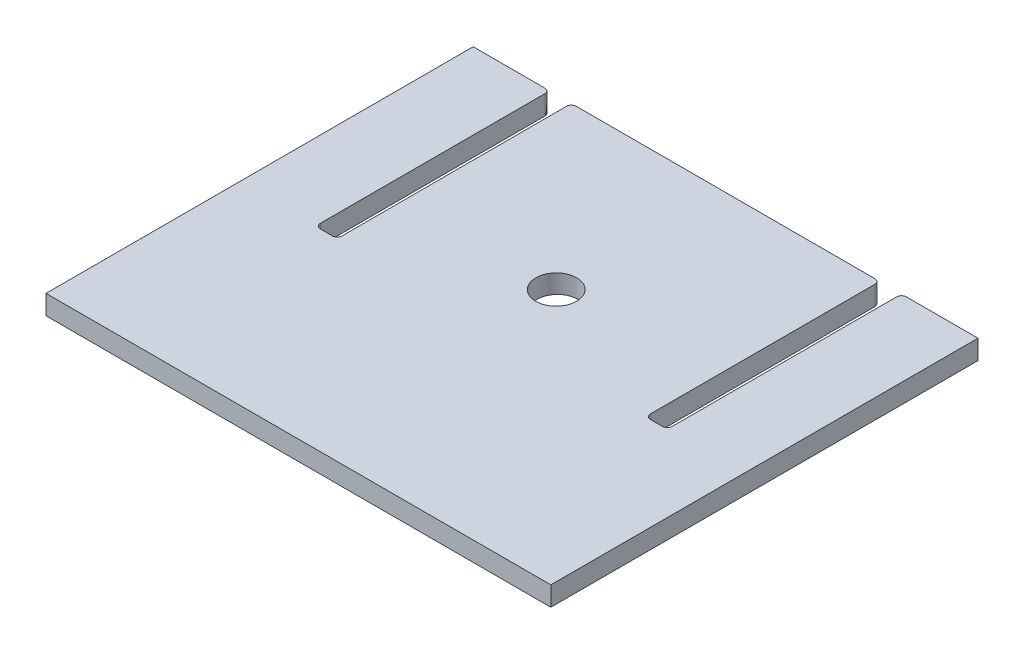
ISO-10303-21;
HEADER;
FILE_DESCRIPTION(('STEP AP214'),'2;1');
FILE_NAME('part.step','',(''),(''),'','','');
FILE_SCHEMA(('AUTOMOTIVE_DESIGN { 1 0 10303 214 1 1 1 1 }'));
ENDSEC;
DATA;
#1=APPLICATION_CONTEXT('core data for automotive mechanical design processes');
#2=APPLICATION_PROTOCOL_DEFINITION('international standard','automotive_design',2000,#1);
#3=PRODUCT_CONTEXT('',#1,'mechanical');
#4=PRODUCT('Part','Part','',(#3));
#5=PRODUCT_RELATED_PRODUCT_CATEGORY('part','',(#4));
#6=PRODUCT_DEFINITION_FORMATION('','',#4);
#7=PRODUCT_DEFINITION_CONTEXT('part definition',#1,'design');
#8=PRODUCT_DEFINITION('design','',#6,#7);
#9=PRODUCT_DEFINITION_SHAPE('','',#8);
#10=(LENGTH_UNIT() NAMED_UNIT(*) SI_UNIT(.MILLI.,.METRE.));
#11=(NAMED_UNIT(*) PLANE_ANGLE_UNIT() SI_UNIT($,.RADIAN.));
#12=(NAMED_UNIT(*) SI_UNIT($,.STERADIAN.) SOLID_ANGLE_UNIT());
#13=UNCERTAINTY_MEASURE_WITH_UNIT(LENGTH_MEASURE(1.E-05),#10,'distance_accuracy_value','');
#14=(GEOMETRIC_REPRESENTATION_CONTEXT(3) GLOBAL_UNCERTAINTY_ASSIGNED_CONTEXT((#13)) GLOBAL_UNIT_ASSIGNED_CONTEXT((#10,
#11,#12)) REPRESENTATION_CONTEXT('',''));
#15=CARTESIAN_POINT('',(0.,0.,0.));
#16=DIRECTION('',(0.,0.,1.));
#17=DIRECTION('',(1.,0.,0.));
#18=AXIS2_PLACEMENT_3D('',#15,#16,#17);
#19=CARTESIAN_POINT('',(-165.1,6.35,-139.7));
#20=DIRECTION('',(0.,0.,1.));
#21=DIRECTION('',(1.,0.,0.));
#22=AXIS2_PLACEMENT_3D('',#19,#20,#21);
#23=PLANE('',#22);
#24=DIRECTION('',(-1.,0.,0.));
#25=VECTOR('',#24,1.);
#26=CARTESIAN_POINT('',(-165.1,6.35,-139.7));
#27=LINE('',#26,#25);
#28=CARTESIAN_POINT('',(-118.237,6.35,-139.7));
#29=VERTEX_POINT('',#28);
#30=CARTESIAN_POINT('',(-165.1,6.35,-139.7));
#31=VERTEX_POINT('',#30);
#32=EDGE_CURVE('E228',#29,#31,#27,.T.);
#33=ORIENTED_EDGE('',*,*,#32,.F.);
#34=DIRECTION('',(0.,1.,0.));
#35=VECTOR('',#34,1.);
#36=CARTESIAN_POINT('',(-118.237,6.35,-139.7));
#37=LINE('',#36,#35);
#38=CARTESIAN_POINT('',(-118.237,-6.35,-139.7));
#39=VERTEX_POINT('',#38);
#40=EDGE_CURVE('E63',#29,#39,#37,.F.);
#41=ORIENTED_EDGE('',*,*,#40,.T.);
#42=DIRECTION('',(-1.,0.,0.));
#43=VECTOR('',#42,1.);
#44=CARTESIAN_POINT('',(-165.1,-6.35,-139.7));
#45=LINE('',#44,#43);
#46=CARTESIAN_POINT('',(-165.1,-6.35,-139.7));
#47=VERTEX_POINT('',#46);
#48=EDGE_CURVE('E417',#39,#47,#45,.T.);
#49=ORIENTED_EDGE('',*,*,#48,.T.);
#50=DIRECTION('',(0.,-1.,0.));
#51=VECTOR('',#50,1.);
#52=CARTESIAN_POINT('',(-165.1,6.35,-139.7));
#53=LINE('',#52,#51);
#54=EDGE_CURVE('E198',#31,#47,#53,.T.);
#55=ORIENTED_EDGE('',*,*,#54,.F.);
#56=EDGE_LOOP('',(#33,#41,#49,#55));
#57=FACE_BOUND('',#56,.T.);
#58=ADVANCED_FACE('F47',(#57),#23,.F.);
#59=CARTESIAN_POINT('',(165.1,-6.35,-139.7));
#60=VERTEX_POINT('',#59);
#61=CARTESIAN_POINT('',(118.237,-6.35,-139.7));
#62=VERTEX_POINT('',#61);
#63=EDGE_CURVE('E212',#60,#62,#45,.T.);
#64=ORIENTED_EDGE('',*,*,#63,.T.);
#65=DIRECTION('',(0.,1.,0.));
#66=VECTOR('',#65,1.);
#67=CARTESIAN_POINT('',(118.237,6.35,-139.7));
#68=LINE('',#67,#66);
#69=CARTESIAN_POINT('',(118.237,6.35,-139.7));
#70=VERTEX_POINT('',#69);
#71=EDGE_CURVE('E328',#62,#70,#68,.T.);
#72=ORIENTED_EDGE('',*,*,#71,.T.);
#73=CARTESIAN_POINT('',(165.1,6.35,-139.7));
#74=VERTEX_POINT('',#73);
#75=EDGE_CURVE('E229',#74,#70,#27,.T.);
#76=ORIENTED_EDGE('',*,*,#75,.F.);
#77=DIRECTION('',(0.,-1.,0.));
#78=VECTOR('',#77,1.);
#79=CARTESIAN_POINT('',(165.1,6.35,-139.7));
#80=LINE('',#79,#78);
#81=EDGE_CURVE('E215',#74,#60,#80,.T.);
#82=ORIENTED_EDGE('',*,*,#81,.T.);
#83=EDGE_LOOP('',(#64,#72,#76,#82));
#84=FACE_BOUND('',#83,.T.);
#85=ADVANCED_FACE('F462',(#84),#23,.F.);
#86=CARTESIAN_POINT('',(165.1,6.35,139.7));
#87=DIRECTION('',(-1.,0.,0.));
#88=DIRECTION('',(0.,0.,1.));
#89=AXIS2_PLACEMENT_3D('',#86,#87,#88);
#90=PLANE('',#89);
#91=DIRECTION('',(0.,0.,-1.));
#92=VECTOR('',#91,1.);
#93=CARTESIAN_POINT('',(165.1,-6.35,139.7));
#94=LINE('',#93,#92);
#95=CARTESIAN_POINT('',(165.1,-6.35,139.7));
#96=VERTEX_POINT('',#95);
#97=EDGE_CURVE('E204',#96,#60,#94,.T.);
#98=ORIENTED_EDGE('',*,*,#97,.T.);
#99=ORIENTED_EDGE('',*,*,#81,.F.);
#100=DIRECTION('',(0.,0.,-1.));
#101=VECTOR('',#100,1.);
#102=CARTESIAN_POINT('',(165.1,6.35,139.7));
#103=LINE('',#102,#101);
#104=CARTESIAN_POINT('',(165.1,6.35,139.7));
#105=VERTEX_POINT('',#104);
#106=EDGE_CURVE('E206',#105,#74,#103,.T.);
#107=ORIENTED_EDGE('',*,*,#106,.F.);
#108=DIRECTION('',(0.,-1.,0.));
#109=VECTOR('',#108,1.);
#110=CARTESIAN_POINT('',(165.1,6.35,139.7));
#111=LINE('',#110,#109);
#112=EDGE_CURVE('E191',#105,#96,#111,.T.);
#113=ORIENTED_EDGE('',*,*,#112,.T.);
#114=EDGE_LOOP('',(#98,#99,#107,#113));
#115=FACE_BOUND('',#114,.T.);
#116=ADVANCED_FACE('F202',(#115),#90,.F.);
#117=CARTESIAN_POINT('',(97.663,6.35,-139.7));
#118=VERTEX_POINT('',#117);
#119=CARTESIAN_POINT('',(-97.663,6.35,-139.7));
#120=VERTEX_POINT('',#119);
#121=EDGE_CURVE('E233',#118,#120,#27,.T.);
#122=ORIENTED_EDGE('',*,*,#121,.F.);
#123=DIRECTION('',(0.,1.,0.));
#124=VECTOR('',#123,1.);
#125=CARTESIAN_POINT('',(97.663,6.35,-139.7));
#126=LINE('',#125,#124);
#127=CARTESIAN_POINT('',(97.663,-6.35,-139.7));
#128=VERTEX_POINT('',#127);
#129=EDGE_CURVE('E314',#118,#128,#126,.F.);
#130=ORIENTED_EDGE('',*,*,#129,.T.);
#131=CARTESIAN_POINT('',(-97.663,-6.35,-139.7));
#132=VERTEX_POINT('',#131);
#133=EDGE_CURVE('E208',#128,#132,#45,.T.);
#134=ORIENTED_EDGE('',*,*,#133,.T.);
#135=DIRECTION('',(0.,1.,0.));
#136=VECTOR('',#135,1.);
#137=CARTESIAN_POINT('',(-97.663,6.35,-139.7));
#138=LINE('',#137,#136);
#139=EDGE_CURVE('E310',#132,#120,#138,.T.);
#140=ORIENTED_EDGE('',*,*,#139,.T.);
#141=EDGE_LOOP('',(#122,#130,#134,#140));
#142=FACE_BOUND('',#141,.T.);
#143=ADVANCED_FACE('F412',(#142),#23,.F.);
#144=CARTESIAN_POINT('',(-165.1,6.35,139.7));
#145=DIRECTION('',(1.,0.,0.));
#146=DIRECTION('',(0.,0.,-1.));
#147=AXIS2_PLACEMENT_3D('',#144,#145,#146);
#148=PLANE('',#147);
#149=DIRECTION('',(0.,0.,1.));
#150=VECTOR('',#149,1.);
#151=CARTESIAN_POINT('',(-165.1,-6.35,139.7));
#152=LINE('',#151,#150);
#153=CARTESIAN_POINT('',(-165.1,-6.35,139.7));
#154=VERTEX_POINT('',#153);
#155=EDGE_CURVE('E416',#47,#154,#152,.T.);
#156=ORIENTED_EDGE('',*,*,#155,.T.);
#157=DIRECTION('',(0.,-1.,0.));
#158=VECTOR('',#157,1.);
#159=CARTESIAN_POINT('',(-165.1,6.35,139.7));
#160=LINE('',#159,#158);
#161=CARTESIAN_POINT('',(-165.1,6.35,139.7));
#162=VERTEX_POINT('',#161);
#163=EDGE_CURVE('E194',#162,#154,#160,.T.);
#164=ORIENTED_EDGE('',*,*,#163,.F.);
#165=DIRECTION('',(0.,0.,1.));
#166=VECTOR('',#165,1.);
#167=CARTESIAN_POINT('',(-165.1,6.35,139.7));
#168=LINE('',#167,#166);
#169=EDGE_CURVE('E225',#31,#162,#168,.T.);
#170=ORIENTED_EDGE('',*,*,#169,.F.);
#171=ORIENTED_EDGE('',*,*,#54,.T.);
#172=EDGE_LOOP('',(#156,#164,#170,#171));
#173=FACE_BOUND('',#172,.T.);
#174=ADVANCED_FACE('F426',(#173),#148,.F.);
#175=CARTESIAN_POINT('',(-165.1,6.35,139.7));
#176=DIRECTION('',(0.,0.,-1.));
#177=DIRECTION('',(-1.,0.,0.));
#178=AXIS2_PLACEMENT_3D('',#175,#176,#177);
#179=PLANE('',#178);
#180=DIRECTION('',(1.,0.,0.));
#181=VECTOR('',#180,1.);
#182=CARTESIAN_POINT('',(-165.1,-6.35,139.7));
#183=LINE('',#182,#181);
#184=EDGE_CURVE('E187',#154,#96,#183,.T.);
#185=ORIENTED_EDGE('',*,*,#184,.T.);
#186=ORIENTED_EDGE('',*,*,#112,.F.);
#187=DIRECTION('',(1.,0.,0.));
#188=VECTOR('',#187,1.);
#189=CARTESIAN_POINT('',(-165.1,6.35,139.7));
#190=LINE('',#189,#188);
#191=EDGE_CURVE('E222',#162,#105,#190,.T.);
#192=ORIENTED_EDGE('',*,*,#191,.F.);
#193=ORIENTED_EDGE('',*,*,#163,.T.);
#194=EDGE_LOOP('',(#185,#186,#192,#193));
#195=FACE_BOUND('',#194,.T.);
#196=ADVANCED_FACE('F189',(#195),#179,.F.);
#197=CARTESIAN_POINT('',(0.,6.35,0.));
#198=DIRECTION('',(0.,-1.,0.));
#199=DIRECTION('',(0.,0.,-1.));
#200=AXIS2_PLACEMENT_3D('',#197,#198,#199);
#201=PLANE('',#200);
#202=CARTESIAN_POINT('',(-0.420618124768386,6.34999999999999,-29.3287996231999));
#203=DIRECTION('',(0.,-1.,0.));
#204=DIRECTION('',(0.0668404015348749,0.,0.997763679797304));
#205=AXIS2_PLACEMENT_3D('',#202,#203,#204);
#206=ELLIPSE('',#205,13.3666033976119,13.335);
#207=CARTESIAN_POINT('',(0.472811013485418,6.34999999999999,-15.9920882308075));
#208=VERTEX_POINT('',#207);
#209=EDGE_CURVE('E240',#208,#208,#206,.F.);
#210=ORIENTED_EDGE('',*,*,#209,.F.);
#211=EDGE_LOOP('',(#210));
#212=FACE_BOUND('',#211,.T.);
#213=DIRECTION('',(0.,0.,1.));
#214=VECTOR('',#213,1.);
#215=CARTESIAN_POINT('',(100.838,6.35,-139.7));
#216=LINE('',#215,#214);
#217=CARTESIAN_POINT('',(100.838,6.35,-136.525));
#218=VERTEX_POINT('',#217);
#219=CARTESIAN_POINT('',(100.838,6.35,10.287));
#220=VERTEX_POINT('',#219);
#221=EDGE_CURVE('E246',#218,#220,#216,.T.);
#222=ORIENTED_EDGE('',*,*,#221,.F.);
#223=CARTESIAN_POINT('',(97.663,6.35,-136.525));
#224=DIRECTION('',(0.,-1.,0.));
#225=DIRECTION('',(0.,0.,-1.));
#226=AXIS2_PLACEMENT_3D('',#223,#224,#225);
#227=CIRCLE('',#226,3.175);
#228=EDGE_CURVE('E307',#218,#118,#227,.F.);
#229=ORIENTED_EDGE('',*,*,#228,.T.);
#230=ORIENTED_EDGE('',*,*,#121,.T.);
#231=CARTESIAN_POINT('',(-97.663,6.35,-136.525));
#232=DIRECTION('',(0.,-1.,0.));
#233=DIRECTION('',(0.,0.,-1.));
#234=AXIS2_PLACEMENT_3D('',#231,#232,#233);
#235=CIRCLE('',#234,3.175);
#236=CARTESIAN_POINT('',(-100.838,6.35,-136.525));
#237=VERTEX_POINT('',#236);
#238=EDGE_CURVE('E301',#120,#237,#235,.F.);
#239=ORIENTED_EDGE('',*,*,#238,.T.);
#240=DIRECTION('',(0.,0.,-1.));
#241=VECTOR('',#240,1.);
#242=CARTESIAN_POINT('',(-100.838,6.35,-139.7));
#243=LINE('',#242,#241);
#244=CARTESIAN_POINT('',(-100.838,6.35,10.287));
#245=VERTEX_POINT('',#244);
#246=EDGE_CURVE('E241',#245,#237,#243,.T.);
#247=ORIENTED_EDGE('',*,*,#246,.F.);
#248=CARTESIAN_POINT('',(-104.013,6.35,10.287));
#249=DIRECTION('',(0.,-1.,0.));
#250=DIRECTION('',(0.,0.,-1.));
#251=AXIS2_PLACEMENT_3D('',#248,#249,#250);
#252=CIRCLE('',#251,3.175);
#253=CARTESIAN_POINT('',(-104.013,6.35,13.462));
#254=VERTEX_POINT('',#253);
#255=EDGE_CURVE('E56',#245,#254,#252,.T.);
#256=ORIENTED_EDGE('',*,*,#255,.T.);
#257=DIRECTION('',(1.,0.,0.));
#258=VECTOR('',#257,1.);
#259=CARTESIAN_POINT('',(-114.3,6.35,13.462));
#260=LINE('',#259,#258);
#261=CARTESIAN_POINT('',(-111.887,6.35,13.462));
#262=VERTEX_POINT('',#261);
#263=EDGE_CURVE('E236',#262,#254,#260,.T.);
#264=ORIENTED_EDGE('',*,*,#263,.F.);
#265=CARTESIAN_POINT('',(-111.887,6.35,10.287));
#266=DIRECTION('',(0.,-1.,0.));
#267=DIRECTION('',(0.,0.,-1.));
#268=AXIS2_PLACEMENT_3D('',#265,#266,#267);
#269=CIRCLE('',#268,3.175);
#270=CARTESIAN_POINT('',(-115.062,6.35,10.287));
#271=VERTEX_POINT('',#270);
#272=EDGE_CURVE('E381',#262,#271,#269,.T.);
#273=ORIENTED_EDGE('',*,*,#272,.T.);
#274=DIRECTION('',(0.,0.,1.));
#275=VECTOR('',#274,1.);
#276=CARTESIAN_POINT('',(-115.062,6.35,-139.7));
#277=LINE('',#276,#275);
#278=CARTESIAN_POINT('',(-115.062,6.35,-136.525));
#279=VERTEX_POINT('',#278);
#280=EDGE_CURVE('E242',#279,#271,#277,.T.);
#281=ORIENTED_EDGE('',*,*,#280,.F.);
#282=CARTESIAN_POINT('',(-118.237,6.35,-136.525));
#283=DIRECTION('',(0.,-1.,0.));
#284=DIRECTION('',(0.,0.,-1.));
#285=AXIS2_PLACEMENT_3D('',#282,#283,#284);
#286=CIRCLE('',#285,3.175);
#287=EDGE_CURVE('E298',#279,#29,#286,.F.);
#288=ORIENTED_EDGE('',*,*,#287,.T.);
#289=ORIENTED_EDGE('',*,*,#32,.T.);
#290=ORIENTED_EDGE('',*,*,#169,.T.);
#291=ORIENTED_EDGE('',*,*,#191,.T.);
#292=ORIENTED_EDGE('',*,*,#106,.T.);
#293=ORIENTED_EDGE('',*,*,#75,.T.);
#294=CARTESIAN_POINT('',(118.237,6.35,-136.525));
#295=DIRECTION('',(0.,-1.,0.));
#296=DIRECTION('',(0.,0.,-1.));
#297=AXIS2_PLACEMENT_3D('',#294,#295,#296);
#298=CIRCLE('',#297,3.175);
#299=CARTESIAN_POINT('',(115.062,6.35,-136.525));
#300=VERTEX_POINT('',#299);
#301=EDGE_CURVE('E304',#70,#300,#298,.F.);
#302=ORIENTED_EDGE('',*,*,#301,.T.);
#303=DIRECTION('',(0.,0.,-1.));
#304=VECTOR('',#303,1.);
#305=CARTESIAN_POINT('',(115.062,6.35,-139.7));
#306=LINE('',#305,#304);
#307=CARTESIAN_POINT('',(115.062,6.35,10.287));
#308=VERTEX_POINT('',#307);
#309=EDGE_CURVE('E268',#308,#300,#306,.T.);
#310=ORIENTED_EDGE('',*,*,#309,.F.);
#311=CARTESIAN_POINT('',(111.887,6.35,10.287));
#312=DIRECTION('',(0.,-1.,0.));
#313=DIRECTION('',(0.,0.,-1.));
#314=AXIS2_PLACEMENT_3D('',#311,#312,#313);
#315=CIRCLE('',#314,3.175);
#316=CARTESIAN_POINT('',(111.887,6.35,13.462));
#317=VERTEX_POINT('',#316);
#318=EDGE_CURVE('E369',#308,#317,#315,.T.);
#319=ORIENTED_EDGE('',*,*,#318,.T.);
#320=DIRECTION('',(1.,0.,0.));
#321=VECTOR('',#320,1.);
#322=CARTESIAN_POINT('',(114.3,6.35,13.462));
#323=LINE('',#322,#321);
#324=CARTESIAN_POINT('',(104.013,6.35,13.462));
#325=VERTEX_POINT('',#324);
#326=EDGE_CURVE('E264',#325,#317,#323,.T.);
#327=ORIENTED_EDGE('',*,*,#326,.F.);
#328=CARTESIAN_POINT('',(104.013,6.35,10.287));
#329=DIRECTION('',(0.,-1.,0.));
#330=DIRECTION('',(0.,0.,-1.));
#331=AXIS2_PLACEMENT_3D('',#328,#329,#330);
#332=CIRCLE('',#331,3.175);
#333=EDGE_CURVE('E375',#325,#220,#332,.T.);
#334=ORIENTED_EDGE('',*,*,#333,.T.);
#335=EDGE_LOOP('',(#222,#229,#230,#239,#247,#256,#264,#273,#281,#288,#289,#290,#291,#292,#293,
#302,#310,#319,#327,#334));
#336=FACE_BOUND('',#335,.T.);
#337=ADVANCED_FACE('F391',(#212,#336),#201,.F.);
#338=CARTESIAN_POINT('',(0.,-6.35,0.));
#339=DIRECTION('',(0.,-1.,0.));
#340=DIRECTION('',(0.,0.,-1.));
#341=AXIS2_PLACEMENT_3D('',#338,#339,#340);
#342=PLANE('',#341);
#343=CARTESIAN_POINT('',(-0.479095155058251,-6.34999999999999,-30.2017186300553));
#344=DIRECTION('',(0.,-1.,0.));
#345=DIRECTION('',(0.0668404015348749,0.,0.997763679797304));
#346=AXIS2_PLACEMENT_3D('',#343,#344,#345);
#347=ELLIPSE('',#346,13.3666033976119,13.335);
#348=CARTESIAN_POINT('',(0.414333983195553,-6.34999999999999,-16.8650072376628));
#349=VERTEX_POINT('',#348);
#350=EDGE_CURVE('E252',#349,#349,#347,.F.);
#351=ORIENTED_EDGE('',*,*,#350,.T.);
#352=EDGE_LOOP('',(#351));
#353=FACE_BOUND('',#352,.T.);
#354=ORIENTED_EDGE('',*,*,#133,.F.);
#355=CARTESIAN_POINT('',(97.663,-6.35,-136.525));
#356=DIRECTION('',(0.,-1.,0.));
#357=DIRECTION('',(0.,0.,-1.));
#358=AXIS2_PLACEMENT_3D('',#355,#356,#357);
#359=CIRCLE('',#358,3.175);
#360=CARTESIAN_POINT('',(100.838,-6.35,-136.525));
#361=VERTEX_POINT('',#360);
#362=EDGE_CURVE('E325',#128,#361,#359,.T.);
#363=ORIENTED_EDGE('',*,*,#362,.T.);
#364=DIRECTION('',(0.,0.,1.));
#365=VECTOR('',#364,1.);
#366=CARTESIAN_POINT('',(100.838,-6.35,-139.7));
#367=LINE('',#366,#365);
#368=CARTESIAN_POINT('',(100.838,-6.35,10.287));
#369=VERTEX_POINT('',#368);
#370=EDGE_CURVE('E260',#361,#369,#367,.T.);
#371=ORIENTED_EDGE('',*,*,#370,.T.);
#372=CARTESIAN_POINT('',(104.013,-6.35,10.287));
#373=DIRECTION('',(0.,-1.,0.));
#374=DIRECTION('',(0.,0.,-1.));
#375=AXIS2_PLACEMENT_3D('',#372,#373,#374);
#376=CIRCLE('',#375,3.175);
#377=CARTESIAN_POINT('',(104.013,-6.35,13.462));
#378=VERTEX_POINT('',#377);
#379=EDGE_CURVE('E378',#369,#378,#376,.F.);
#380=ORIENTED_EDGE('',*,*,#379,.T.);
#381=DIRECTION('',(1.,0.,0.));
#382=VECTOR('',#381,1.);
#383=CARTESIAN_POINT('',(114.3,-6.35,13.462));
#384=LINE('',#383,#382);
#385=CARTESIAN_POINT('',(111.887,-6.35,13.462));
#386=VERTEX_POINT('',#385);
#387=EDGE_CURVE('E275',#378,#386,#384,.T.);
#388=ORIENTED_EDGE('',*,*,#387,.T.);
#389=CARTESIAN_POINT('',(111.887,-6.35,10.287));
#390=DIRECTION('',(0.,-1.,0.));
#391=DIRECTION('',(0.,0.,-1.));
#392=AXIS2_PLACEMENT_3D('',#389,#390,#391);
#393=CIRCLE('',#392,3.175);
#394=CARTESIAN_POINT('',(115.062,-6.35,10.287));
#395=VERTEX_POINT('',#394);
#396=EDGE_CURVE('E372',#386,#395,#393,.F.);
#397=ORIENTED_EDGE('',*,*,#396,.T.);
#398=DIRECTION('',(0.,0.,-1.));
#399=VECTOR('',#398,1.);
#400=CARTESIAN_POINT('',(115.062,-6.35,-139.7));
#401=LINE('',#400,#399);
#402=CARTESIAN_POINT('',(115.062,-6.35,-136.525));
#403=VERTEX_POINT('',#402);
#404=EDGE_CURVE('E279',#395,#403,#401,.T.);
#405=ORIENTED_EDGE('',*,*,#404,.T.);
#406=CARTESIAN_POINT('',(118.237,-6.35,-136.525));
#407=DIRECTION('',(0.,-1.,0.));
#408=DIRECTION('',(0.,0.,-1.));
#409=AXIS2_PLACEMENT_3D('',#406,#407,#408);
#410=CIRCLE('',#409,3.175);
#411=EDGE_CURVE('E71',#403,#62,#410,.T.);
#412=ORIENTED_EDGE('',*,*,#411,.T.);
#413=ORIENTED_EDGE('',*,*,#63,.F.);
#414=ORIENTED_EDGE('',*,*,#97,.F.);
#415=ORIENTED_EDGE('',*,*,#184,.F.);
#416=ORIENTED_EDGE('',*,*,#155,.F.);
#417=ORIENTED_EDGE('',*,*,#48,.F.);
#418=CARTESIAN_POINT('',(-118.237,-6.35,-136.525));
#419=DIRECTION('',(0.,-1.,0.));
#420=DIRECTION('',(0.,0.,-1.));
#421=AXIS2_PLACEMENT_3D('',#418,#419,#420);
#422=CIRCLE('',#421,3.175);
#423=CARTESIAN_POINT('',(-115.062,-6.35,-136.525));
#424=VERTEX_POINT('',#423);
#425=EDGE_CURVE('E317',#39,#424,#422,.T.);
#426=ORIENTED_EDGE('',*,*,#425,.T.);
#427=DIRECTION('',(0.,0.,1.));
#428=VECTOR('',#427,1.);
#429=CARTESIAN_POINT('',(-115.062,-6.35,-139.7));
#430=LINE('',#429,#428);
#431=CARTESIAN_POINT('',(-115.062,-6.35,10.287));
#432=VERTEX_POINT('',#431);
#433=EDGE_CURVE('E247',#424,#432,#430,.T.);
#434=ORIENTED_EDGE('',*,*,#433,.T.);
#435=CARTESIAN_POINT('',(-111.887,-6.35,10.287));
#436=DIRECTION('',(0.,-1.,0.));
#437=DIRECTION('',(0.,0.,-1.));
#438=AXIS2_PLACEMENT_3D('',#435,#436,#437);
#439=CIRCLE('',#438,3.175);
#440=CARTESIAN_POINT('',(-111.887,-6.35,13.462));
#441=VERTEX_POINT('',#440);
#442=EDGE_CURVE('E384',#432,#441,#439,.F.);
#443=ORIENTED_EDGE('',*,*,#442,.T.);
#444=DIRECTION('',(1.,0.,0.));
#445=VECTOR('',#444,1.);
#446=CARTESIAN_POINT('',(-114.3,-6.35,13.462));
#447=LINE('',#446,#445);
#448=CARTESIAN_POINT('',(-104.013,-6.35,13.462));
#449=VERTEX_POINT('',#448);
#450=EDGE_CURVE('E251',#441,#449,#447,.T.);
#451=ORIENTED_EDGE('',*,*,#450,.T.);
#452=CARTESIAN_POINT('',(-104.013,-6.35,10.287));
#453=DIRECTION('',(0.,-1.,0.));
#454=DIRECTION('',(0.,0.,-1.));
#455=AXIS2_PLACEMENT_3D('',#452,#453,#454);
#456=CIRCLE('',#455,3.175);
#457=CARTESIAN_POINT('',(-100.838,-6.35,10.287));
#458=VERTEX_POINT('',#457);
#459=EDGE_CURVE('E12',#449,#458,#456,.F.);
#460=ORIENTED_EDGE('',*,*,#459,.T.);
#461=DIRECTION('',(0.,0.,-1.));
#462=VECTOR('',#461,1.);
#463=CARTESIAN_POINT('',(-100.838,-6.35,-139.7));
#464=LINE('',#463,#462);
#465=CARTESIAN_POINT('',(-100.838,-6.35,-136.525));
#466=VERTEX_POINT('',#465);
#467=EDGE_CURVE('E256',#458,#466,#464,.T.);
#468=ORIENTED_EDGE('',*,*,#467,.T.);
#469=CARTESIAN_POINT('',(-97.663,-6.35,-136.525));
#470=DIRECTION('',(0.,-1.,0.));
#471=DIRECTION('',(0.,0.,-1.));
#472=AXIS2_PLACEMENT_3D('',#469,#470,#471);
#473=CIRCLE('',#472,3.175);
#474=EDGE_CURVE('E320',#466,#132,#473,.T.);
#475=ORIENTED_EDGE('',*,*,#474,.T.);
#476=EDGE_LOOP('',(#354,#363,#371,#380,#388,#397,#405,#412,#413,#414,#415,#416,#417,#426,#434,
#443,#451,#460,#468,#475));
#477=FACE_BOUND('',#476,.T.);
#478=ADVANCED_FACE('F211',(#353,#477),#342,.T.);
#479=CARTESIAN_POINT('',(115.062,-6.35,-139.7));
#480=DIRECTION('',(1.,0.,0.));
#481=DIRECTION('',(0.,0.,-1.));
#482=AXIS2_PLACEMENT_3D('',#479,#480,#481);
#483=PLANE('',#482);
#484=ORIENTED_EDGE('',*,*,#309,.T.);
#485=DIRECTION('',(0.,1.,0.));
#486=VECTOR('',#485,1.);
#487=CARTESIAN_POINT('',(115.062,-6.35,-136.525));
#488=LINE('',#487,#486);
#489=EDGE_CURVE('E336',#300,#403,#488,.F.);
#490=ORIENTED_EDGE('',*,*,#489,.T.);
#491=ORIENTED_EDGE('',*,*,#404,.F.);
#492=DIRECTION('',(0.,1.,0.));
#493=VECTOR('',#492,1.);
#494=CARTESIAN_POINT('',(115.062,6.35,10.287));
#495=LINE('',#494,#493);
#496=EDGE_CURVE('E332',#395,#308,#495,.T.);
#497=ORIENTED_EDGE('',*,*,#496,.T.);
#498=EDGE_LOOP('',(#484,#490,#491,#497));
#499=FACE_BOUND('',#498,.T.);
#500=ADVANCED_FACE('F455',(#499),#483,.F.);
#501=CARTESIAN_POINT('',(114.3,-6.35,13.462));
#502=DIRECTION('',(0.,0.,1.));
#503=DIRECTION('',(1.,0.,0.));
#504=AXIS2_PLACEMENT_3D('',#501,#502,#503);
#505=PLANE('',#504);
#506=ORIENTED_EDGE('',*,*,#326,.T.);
#507=DIRECTION('',(0.,1.,0.));
#508=VECTOR('',#507,1.);
#509=CARTESIAN_POINT('',(111.887,-6.35,13.462));
#510=LINE('',#509,#508);
#511=EDGE_CURVE('E359',#317,#386,#510,.F.);
#512=ORIENTED_EDGE('',*,*,#511,.T.);
#513=ORIENTED_EDGE('',*,*,#387,.F.);
#514=DIRECTION('',(0.,1.,0.));
#515=VECTOR('',#514,1.);
#516=CARTESIAN_POINT('',(104.013,6.35,13.462));
#517=LINE('',#516,#515);
#518=EDGE_CURVE('E355',#378,#325,#517,.T.);
#519=ORIENTED_EDGE('',*,*,#518,.T.);
#520=EDGE_LOOP('',(#506,#512,#513,#519));
#521=FACE_BOUND('',#520,.T.);
#522=ADVANCED_FACE('F447',(#521),#505,.F.);
#523=CARTESIAN_POINT('',(100.838,-6.35,-139.7));
#524=DIRECTION('',(-1.,0.,0.));
#525=DIRECTION('',(0.,0.,1.));
#526=AXIS2_PLACEMENT_3D('',#523,#524,#525);
#527=PLANE('',#526);
#528=ORIENTED_EDGE('',*,*,#370,.F.);
#529=DIRECTION('',(0.,1.,0.));
#530=VECTOR('',#529,1.);
#531=CARTESIAN_POINT('',(100.838,-6.35,-136.525));
#532=LINE('',#531,#530);
#533=EDGE_CURVE('E294',#361,#218,#532,.T.);
#534=ORIENTED_EDGE('',*,*,#533,.T.);
#535=ORIENTED_EDGE('',*,*,#221,.T.);
#536=DIRECTION('',(0.,1.,0.));
#537=VECTOR('',#536,1.);
#538=CARTESIAN_POINT('',(100.838,-6.35,10.287));
#539=LINE('',#538,#537);
#540=EDGE_CURVE('E291',#220,#369,#539,.F.);
#541=ORIENTED_EDGE('',*,*,#540,.T.);
#542=EDGE_LOOP('',(#528,#534,#535,#541));
#543=FACE_BOUND('',#542,.T.);
#544=ADVANCED_FACE('F439',(#543),#527,.F.);
#545=CARTESIAN_POINT('',(-115.062,-6.35,-139.7));
#546=DIRECTION('',(-1.,0.,0.));
#547=DIRECTION('',(0.,0.,1.));
#548=AXIS2_PLACEMENT_3D('',#545,#546,#547);
#549=PLANE('',#548);
#550=ORIENTED_EDGE('',*,*,#433,.F.);
#551=DIRECTION('',(0.,1.,0.));
#552=VECTOR('',#551,1.);
#553=CARTESIAN_POINT('',(-115.062,-6.35,-136.525));
#554=LINE('',#553,#552);
#555=EDGE_CURVE('E349',#424,#279,#554,.T.);
#556=ORIENTED_EDGE('',*,*,#555,.T.);
#557=ORIENTED_EDGE('',*,*,#280,.T.);
#558=DIRECTION('',(0.,1.,0.));
#559=VECTOR('',#558,1.);
#560=CARTESIAN_POINT('',(-115.062,-6.35,10.287));
#561=LINE('',#560,#559);
#562=EDGE_CURVE('E346',#271,#432,#561,.F.);
#563=ORIENTED_EDGE('',*,*,#562,.T.);
#564=EDGE_LOOP('',(#550,#556,#557,#563));
#565=FACE_BOUND('',#564,.T.);
#566=ADVANCED_FACE('F493',(#565),#549,.F.);
#567=CARTESIAN_POINT('',(-100.838,-6.35,-139.7));
#568=DIRECTION('',(1.,0.,0.));
#569=DIRECTION('',(0.,0.,-1.));
#570=AXIS2_PLACEMENT_3D('',#567,#568,#569);
#571=PLANE('',#570);
#572=ORIENTED_EDGE('',*,*,#246,.T.);
#573=DIRECTION('',(0.,1.,0.));
#574=VECTOR('',#573,1.);
#575=CARTESIAN_POINT('',(-100.838,-6.35,-136.525));
#576=LINE('',#575,#574);
#577=EDGE_CURVE('E343',#237,#466,#576,.F.);
#578=ORIENTED_EDGE('',*,*,#577,.T.);
#579=ORIENTED_EDGE('',*,*,#467,.F.);
#580=DIRECTION('',(0.,1.,0.));
#581=VECTOR('',#580,1.);
#582=CARTESIAN_POINT('',(-100.838,6.35,10.287));
#583=LINE('',#582,#581);
#584=EDGE_CURVE('E339',#458,#245,#583,.T.);
#585=ORIENTED_EDGE('',*,*,#584,.T.);
#586=EDGE_LOOP('',(#572,#578,#579,#585));
#587=FACE_BOUND('',#586,.T.);
#588=ADVANCED_FACE('F403',(#587),#571,.F.);
#589=CARTESIAN_POINT('',(-114.3,-6.35,13.462));
#590=DIRECTION('',(0.,0.,1.));
#591=DIRECTION('',(1.,0.,0.));
#592=AXIS2_PLACEMENT_3D('',#589,#590,#591);
#593=PLANE('',#592);
#594=ORIENTED_EDGE('',*,*,#450,.F.);
#595=DIRECTION('',(0.,1.,0.));
#596=VECTOR('',#595,1.);
#597=CARTESIAN_POINT('',(-111.887,6.35,13.462));
#598=LINE('',#597,#596);
#599=EDGE_CURVE('E365',#441,#262,#598,.T.);
#600=ORIENTED_EDGE('',*,*,#599,.T.);
#601=ORIENTED_EDGE('',*,*,#263,.T.);
#602=DIRECTION('',(0.,1.,0.));
#603=VECTOR('',#602,1.);
#604=CARTESIAN_POINT('',(-104.013,-6.35,13.462));
#605=LINE('',#604,#603);
#606=EDGE_CURVE('E362',#254,#449,#605,.F.);
#607=ORIENTED_EDGE('',*,*,#606,.T.);
#608=EDGE_LOOP('',(#594,#600,#601,#607));
#609=FACE_BOUND('',#608,.T.);
#610=ADVANCED_FACE('F397',(#609),#593,.F.);
#611=CARTESIAN_POINT('',(-0.803083946952388,-76.7136562366382,-35.0380787025588));
#612=DIRECTION('',(0.00459360392299275,0.9976356448477,0.0685712690003091));
#613=DIRECTION('',(0.,-0.0685719924796867,0.99764617066742));
#614=AXIS2_PLACEMENT_3D('',#611,#612,#613);
#615=CYLINDRICAL_SURFACE('',#614,13.335);
#616=ORIENTED_EDGE('',*,*,#350,.F.);
#617=EDGE_LOOP('',(#616));
#618=FACE_BOUND('',#617,.T.);
#619=ORIENTED_EDGE('',*,*,#209,.T.);
#620=EDGE_LOOP('',(#619));
#621=FACE_BOUND('',#620,.T.);
#622=ADVANCED_FACE('F488',(#618,#621),#615,.F.);
#623=CARTESIAN_POINT('',(97.663,-6.35,-136.525));
#624=DIRECTION('',(0.,1.,0.));
#625=DIRECTION('',(0.,0.,1.));
#626=AXIS2_PLACEMENT_3D('',#623,#624,#625);
#627=CYLINDRICAL_SURFACE('',#626,3.175);
#628=ORIENTED_EDGE('',*,*,#362,.F.);
#629=ORIENTED_EDGE('',*,*,#129,.F.);
#630=ORIENTED_EDGE('',*,*,#228,.F.);
#631=ORIENTED_EDGE('',*,*,#533,.F.);
#632=EDGE_LOOP('',(#628,#629,#630,#631));
#633=FACE_BOUND('',#632,.T.);
#634=ADVANCED_FACE('F434',(#633),#627,.T.);
#635=CARTESIAN_POINT('',(118.237,6.35,-136.525));
#636=DIRECTION('',(0.,1.,0.));
#637=DIRECTION('',(0.,0.,1.));
#638=AXIS2_PLACEMENT_3D('',#635,#636,#637);
#639=CYLINDRICAL_SURFACE('',#638,3.175);
#640=ORIENTED_EDGE('',*,*,#411,.F.);
#641=ORIENTED_EDGE('',*,*,#489,.F.);
#642=ORIENTED_EDGE('',*,*,#301,.F.);
#643=ORIENTED_EDGE('',*,*,#71,.F.);
#644=EDGE_LOOP('',(#640,#641,#642,#643));
#645=FACE_BOUND('',#644,.T.);
#646=ADVANCED_FACE('F459',(#645),#639,.T.);
#647=CARTESIAN_POINT('',(-97.663,6.35,-136.525));
#648=DIRECTION('',(0.,1.,0.));
#649=DIRECTION('',(0.,0.,1.));
#650=AXIS2_PLACEMENT_3D('',#647,#648,#649);
#651=CYLINDRICAL_SURFACE('',#650,3.175);
#652=ORIENTED_EDGE('',*,*,#474,.F.);
#653=ORIENTED_EDGE('',*,*,#577,.F.);
#654=ORIENTED_EDGE('',*,*,#238,.F.);
#655=ORIENTED_EDGE('',*,*,#139,.F.);
#656=EDGE_LOOP('',(#652,#653,#654,#655));
#657=FACE_BOUND('',#656,.T.);
#658=ADVANCED_FACE('F406',(#657),#651,.T.);
#659=CARTESIAN_POINT('',(-118.237,-6.35,-136.525));
#660=DIRECTION('',(0.,1.,0.));
#661=DIRECTION('',(0.,0.,1.));
#662=AXIS2_PLACEMENT_3D('',#659,#660,#661);
#663=CYLINDRICAL_SURFACE('',#662,3.175);
#664=ORIENTED_EDGE('',*,*,#425,.F.);
#665=ORIENTED_EDGE('',*,*,#40,.F.);
#666=ORIENTED_EDGE('',*,*,#287,.F.);
#667=ORIENTED_EDGE('',*,*,#555,.F.);
#668=EDGE_LOOP('',(#664,#665,#666,#667));
#669=FACE_BOUND('',#668,.T.);
#670=ADVANCED_FACE('F510',(#669),#663,.T.);
#671=CARTESIAN_POINT('',(111.887,-6.35,10.287));
#672=DIRECTION('',(0.,-1.,0.));
#673=DIRECTION('',(0.,0.,-1.));
#674=AXIS2_PLACEMENT_3D('',#671,#672,#673);
#675=CYLINDRICAL_SURFACE('',#674,3.175);
#676=ORIENTED_EDGE('',*,*,#396,.F.);
#677=ORIENTED_EDGE('',*,*,#511,.F.);
#678=ORIENTED_EDGE('',*,*,#318,.F.);
#679=ORIENTED_EDGE('',*,*,#496,.F.);
#680=EDGE_LOOP('',(#676,#677,#678,#679));
#681=FACE_BOUND('',#680,.T.);
#682=ADVANCED_FACE('F451',(#681),#675,.F.);
#683=CARTESIAN_POINT('',(104.013,-6.35,10.287));
#684=DIRECTION('',(0.,-1.,0.));
#685=DIRECTION('',(0.,0.,-1.));
#686=AXIS2_PLACEMENT_3D('',#683,#684,#685);
#687=CYLINDRICAL_SURFACE('',#686,3.175);
#688=ORIENTED_EDGE('',*,*,#379,.F.);
#689=ORIENTED_EDGE('',*,*,#540,.F.);
#690=ORIENTED_EDGE('',*,*,#333,.F.);
#691=ORIENTED_EDGE('',*,*,#518,.F.);
#692=EDGE_LOOP('',(#688,#689,#690,#691));
#693=FACE_BOUND('',#692,.T.);
#694=ADVANCED_FACE('F442',(#693),#687,.F.);
#695=CARTESIAN_POINT('',(-111.887,-6.35,10.287));
#696=DIRECTION('',(0.,-1.,0.));
#697=DIRECTION('',(0.,0.,-1.));
#698=AXIS2_PLACEMENT_3D('',#695,#696,#697);
#699=CYLINDRICAL_SURFACE('',#698,3.175);
#700=ORIENTED_EDGE('',*,*,#442,.F.);
#701=ORIENTED_EDGE('',*,*,#562,.F.);
#702=ORIENTED_EDGE('',*,*,#272,.F.);
#703=ORIENTED_EDGE('',*,*,#599,.F.);
#704=EDGE_LOOP('',(#700,#701,#702,#703));
#705=FACE_BOUND('',#704,.T.);
#706=ADVANCED_FACE('F517',(#705),#699,.F.);
#707=CARTESIAN_POINT('',(-104.013,-6.35,10.287));
#708=DIRECTION('',(0.,-1.,0.));
#709=DIRECTION('',(0.,0.,-1.));
#710=AXIS2_PLACEMENT_3D('',#707,#708,#709);
#711=CYLINDRICAL_SURFACE('',#710,3.175);
#712=ORIENTED_EDGE('',*,*,#459,.F.);
#713=ORIENTED_EDGE('',*,*,#606,.F.);
#714=ORIENTED_EDGE('',*,*,#255,.F.);
#715=ORIENTED_EDGE('',*,*,#584,.F.);
#716=EDGE_LOOP('',(#712,#713,#714,#715));
#717=FACE_BOUND('',#716,.T.);
#718=ADVANCED_FACE('F49',(#717),#711,.F.);
#719=CLOSED_SHELL('',(#58,#85,#116,#143,#174,#196,#337,#478,#500,#522,#544,#566,#588,#610,#622,
#634,#646,#658,#670,#682,#694,#706,#718));
#720=MANIFOLD_SOLID_BREP('B2',#719);
#721=ADVANCED_BREP_SHAPE_REPRESENTATION('',(#18,#720),#14);
#722=SHAPE_DEFINITION_REPRESENTATION(#9,#721);
ENDSEC;
END-ISO-10303-21;
